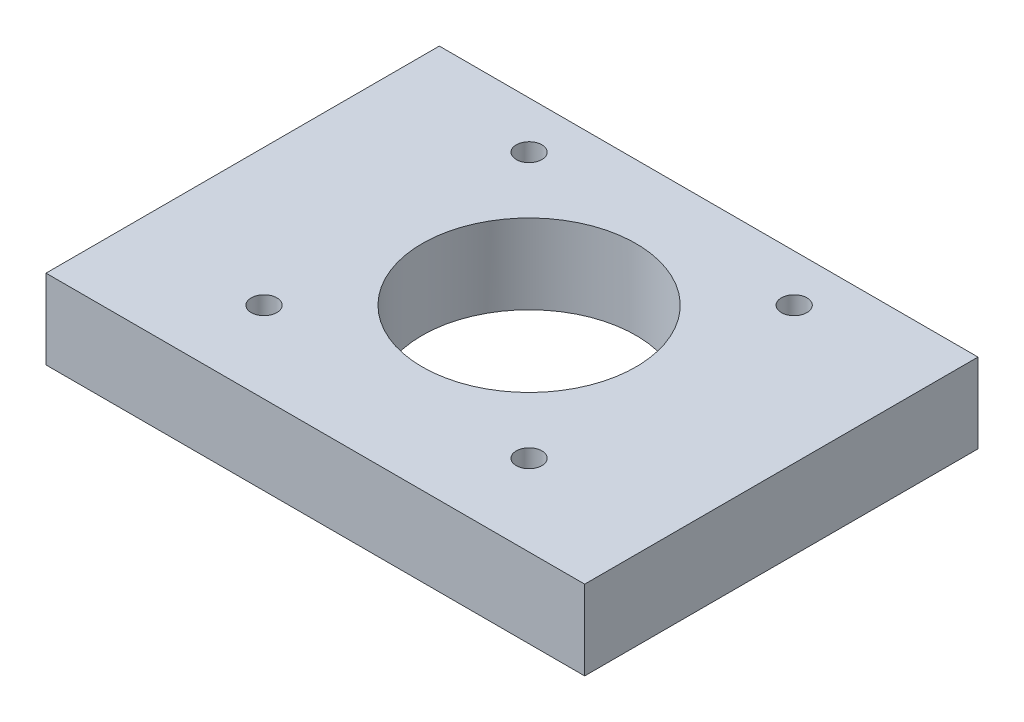
ISO-10303-21;
HEADER;
FILE_DESCRIPTION(('STEP AP214'),'2;1');
FILE_NAME('part.step','',(''),(''),'','','');
FILE_SCHEMA(('AUTOMOTIVE_DESIGN { 1 0 10303 214 1 1 1 1 }'));
ENDSEC;
DATA;
#1=APPLICATION_CONTEXT('core data for automotive mechanical design processes');
#2=APPLICATION_PROTOCOL_DEFINITION('international standard','automotive_design',2000,#1);
#3=PRODUCT_CONTEXT('',#1,'mechanical');
#4=PRODUCT('Part','Part','',(#3));
#5=PRODUCT_RELATED_PRODUCT_CATEGORY('part','',(#4));
#6=PRODUCT_DEFINITION_FORMATION('','',#4);
#7=PRODUCT_DEFINITION_CONTEXT('part definition',#1,'design');
#8=PRODUCT_DEFINITION('design','',#6,#7);
#9=PRODUCT_DEFINITION_SHAPE('','',#8);
#10=(LENGTH_UNIT() NAMED_UNIT(*) SI_UNIT(.MILLI.,.METRE.));
#11=(NAMED_UNIT(*) PLANE_ANGLE_UNIT() SI_UNIT($,.RADIAN.));
#12=(NAMED_UNIT(*) SI_UNIT($,.STERADIAN.) SOLID_ANGLE_UNIT());
#13=UNCERTAINTY_MEASURE_WITH_UNIT(LENGTH_MEASURE(1.E-05),#10,'distance_accuracy_value','');
#14=(GEOMETRIC_REPRESENTATION_CONTEXT(3) GLOBAL_UNCERTAINTY_ASSIGNED_CONTEXT((#13)) GLOBAL_UNIT_ASSIGNED_CONTEXT((#10,
#11,#12)) REPRESENTATION_CONTEXT('',''));
#15=CARTESIAN_POINT('',(0.,0.,0.));
#16=DIRECTION('',(0.,0.,1.));
#17=DIRECTION('',(1.,0.,0.));
#18=AXIS2_PLACEMENT_3D('',#15,#16,#17);
#19=CARTESIAN_POINT('',(31.5,9.3,46.));
#20=DIRECTION('',(-1.,0.,0.));
#21=DIRECTION('',(0.,0.,1.));
#22=AXIS2_PLACEMENT_3D('',#19,#20,#21);
#23=PLANE('',#22);
#24=DIRECTION('',(0.,1.,0.));
#25=VECTOR('',#24,1.);
#26=CARTESIAN_POINT('',(31.5,9.3,0.));
#27=LINE('',#26,#25);
#28=CARTESIAN_POINT('',(31.5,0.,0.));
#29=VERTEX_POINT('',#28);
#30=CARTESIAN_POINT('',(31.5,9.3,0.));
#31=VERTEX_POINT('',#30);
#32=EDGE_CURVE('E95',#29,#31,#27,.T.);
#33=ORIENTED_EDGE('',*,*,#32,.T.);
#34=DIRECTION('',(0.,0.,-1.));
#35=VECTOR('',#34,1.);
#36=CARTESIAN_POINT('',(31.5,9.3,46.));
#37=LINE('',#36,#35);
#38=CARTESIAN_POINT('',(31.5,9.3,46.));
#39=VERTEX_POINT('',#38);
#40=EDGE_CURVE('E48',#39,#31,#37,.T.);
#41=ORIENTED_EDGE('',*,*,#40,.F.);
#42=DIRECTION('',(0.,1.,0.));
#43=VECTOR('',#42,1.);
#44=CARTESIAN_POINT('',(31.5,9.3,46.));
#45=LINE('',#44,#43);
#46=CARTESIAN_POINT('',(31.5,0.,46.));
#47=VERTEX_POINT('',#46);
#48=EDGE_CURVE('E87',#47,#39,#45,.T.);
#49=ORIENTED_EDGE('',*,*,#48,.F.);
#50=DIRECTION('',(0.,0.,-1.));
#51=VECTOR('',#50,1.);
#52=CARTESIAN_POINT('',(31.5,0.,46.));
#53=LINE('',#52,#51);
#54=EDGE_CURVE('E11',#47,#29,#53,.T.);
#55=ORIENTED_EDGE('',*,*,#54,.T.);
#56=EDGE_LOOP('',(#33,#41,#49,#55));
#57=FACE_BOUND('',#56,.T.);
#58=ADVANCED_FACE('F39',(#57),#23,.F.);
#59=CARTESIAN_POINT('',(-31.5,9.3,46.));
#60=DIRECTION('',(0.,-1.,0.));
#61=DIRECTION('',(0.,0.,-1.));
#62=AXIS2_PLACEMENT_3D('',#59,#60,#61);
#63=PLANE('',#62);
#64=CARTESIAN_POINT('',(15.5,9.3,36.5));
#65=DIRECTION('',(0.,1.,0.));
#66=DIRECTION('',(0.,0.,1.));
#67=AXIS2_PLACEMENT_3D('',#64,#65,#66);
#68=CIRCLE('',#67,1.5);
#69=CARTESIAN_POINT('',(15.5,9.3,38.));
#70=VERTEX_POINT('',#69);
#71=EDGE_CURVE('E148',#70,#70,#68,.T.);
#72=ORIENTED_EDGE('',*,*,#71,.F.);
#73=EDGE_LOOP('',(#72));
#74=FACE_BOUND('',#73,.T.);
#75=CARTESIAN_POINT('',(15.5,9.3,5.49999999999999));
#76=DIRECTION('',(0.,1.,0.));
#77=DIRECTION('',(0.,0.,-1.));
#78=AXIS2_PLACEMENT_3D('',#75,#76,#77);
#79=CIRCLE('',#78,1.5);
#80=CARTESIAN_POINT('',(15.5,9.3,3.99999999999999));
#81=VERTEX_POINT('',#80);
#82=EDGE_CURVE('E152',#81,#81,#79,.T.);
#83=ORIENTED_EDGE('',*,*,#82,.F.);
#84=EDGE_LOOP('',(#83));
#85=FACE_BOUND('',#84,.T.);
#86=CARTESIAN_POINT('',(-15.5,9.3,36.5));
#87=DIRECTION('',(0.,1.,0.));
#88=DIRECTION('',(0.,0.,-1.));
#89=AXIS2_PLACEMENT_3D('',#86,#87,#88);
#90=CIRCLE('',#89,1.5);
#91=CARTESIAN_POINT('',(-15.5,9.3,35.));
#92=VERTEX_POINT('',#91);
#93=EDGE_CURVE('E156',#92,#92,#90,.T.);
#94=ORIENTED_EDGE('',*,*,#93,.F.);
#95=EDGE_LOOP('',(#94));
#96=FACE_BOUND('',#95,.T.);
#97=CARTESIAN_POINT('',(-15.5,9.3,5.49999999999999));
#98=DIRECTION('',(0.,1.,0.));
#99=DIRECTION('',(0.,0.,1.));
#100=AXIS2_PLACEMENT_3D('',#97,#98,#99);
#101=CIRCLE('',#100,1.5);
#102=CARTESIAN_POINT('',(-15.5,9.3,6.99999999999999));
#103=VERTEX_POINT('',#102);
#104=EDGE_CURVE('E160',#103,#103,#101,.T.);
#105=ORIENTED_EDGE('',*,*,#104,.F.);
#106=EDGE_LOOP('',(#105));
#107=FACE_BOUND('',#106,.T.);
#108=CARTESIAN_POINT('',(0.,9.3,21.));
#109=DIRECTION('',(0.,1.,0.));
#110=DIRECTION('',(0.,0.,1.));
#111=AXIS2_PLACEMENT_3D('',#108,#109,#110);
#112=CIRCLE('',#111,12.5);
#113=CARTESIAN_POINT('',(0.,9.3,33.5));
#114=VERTEX_POINT('',#113);
#115=EDGE_CURVE('E163',#114,#114,#112,.T.);
#116=ORIENTED_EDGE('',*,*,#115,.F.);
#117=EDGE_LOOP('',(#116));
#118=FACE_BOUND('',#117,.T.);
#119=DIRECTION('',(-1.,0.,0.));
#120=VECTOR('',#119,1.);
#121=CARTESIAN_POINT('',(-31.5,9.3,0.));
#122=LINE('',#121,#120);
#123=CARTESIAN_POINT('',(-31.5,9.3,0.));
#124=VERTEX_POINT('',#123);
#125=EDGE_CURVE('E74',#31,#124,#122,.T.);
#126=ORIENTED_EDGE('',*,*,#125,.T.);
#127=DIRECTION('',(0.,0.,-1.));
#128=VECTOR('',#127,1.);
#129=CARTESIAN_POINT('',(-31.5,9.3,46.));
#130=LINE('',#129,#128);
#131=CARTESIAN_POINT('',(-31.5,9.3,46.));
#132=VERTEX_POINT('',#131);
#133=EDGE_CURVE('E97',#132,#124,#130,.T.);
#134=ORIENTED_EDGE('',*,*,#133,.F.);
#135=DIRECTION('',(-1.,0.,0.));
#136=VECTOR('',#135,1.);
#137=CARTESIAN_POINT('',(-31.5,9.3,46.));
#138=LINE('',#137,#136);
#139=EDGE_CURVE('E91',#39,#132,#138,.T.);
#140=ORIENTED_EDGE('',*,*,#139,.F.);
#141=ORIENTED_EDGE('',*,*,#40,.T.);
#142=EDGE_LOOP('',(#126,#134,#140,#141));
#143=FACE_BOUND('',#142,.T.);
#144=ADVANCED_FACE('F98',(#74,#85,#96,#107,#118,#143),#63,.F.);
#145=CARTESIAN_POINT('',(-31.5,0.,46.));
#146=DIRECTION('',(1.,0.,0.));
#147=DIRECTION('',(0.,0.,-1.));
#148=AXIS2_PLACEMENT_3D('',#145,#146,#147);
#149=PLANE('',#148);
#150=DIRECTION('',(0.,-1.,0.));
#151=VECTOR('',#150,1.);
#152=CARTESIAN_POINT('',(-31.5,0.,0.));
#153=LINE('',#152,#151);
#154=CARTESIAN_POINT('',(-31.5,0.,0.));
#155=VERTEX_POINT('',#154);
#156=EDGE_CURVE('E81',#124,#155,#153,.T.);
#157=ORIENTED_EDGE('',*,*,#156,.T.);
#158=DIRECTION('',(0.,0.,-1.));
#159=VECTOR('',#158,1.);
#160=CARTESIAN_POINT('',(-31.5,0.,46.));
#161=LINE('',#160,#159);
#162=CARTESIAN_POINT('',(-31.5,0.,46.));
#163=VERTEX_POINT('',#162);
#164=EDGE_CURVE('E104',#163,#155,#161,.T.);
#165=ORIENTED_EDGE('',*,*,#164,.F.);
#166=DIRECTION('',(0.,-1.,0.));
#167=VECTOR('',#166,1.);
#168=CARTESIAN_POINT('',(-31.5,0.,46.));
#169=LINE('',#168,#167);
#170=EDGE_CURVE('E101',#132,#163,#169,.T.);
#171=ORIENTED_EDGE('',*,*,#170,.F.);
#172=ORIENTED_EDGE('',*,*,#133,.T.);
#173=EDGE_LOOP('',(#157,#165,#171,#172));
#174=FACE_BOUND('',#173,.T.);
#175=ADVANCED_FACE('F121',(#174),#149,.F.);
#176=CARTESIAN_POINT('',(0.,0.,46.));
#177=DIRECTION('',(0.,1.,0.));
#178=DIRECTION('',(-1.,0.,0.));
#179=AXIS2_PLACEMENT_3D('',#176,#177,#178);
#180=PLANE('',#179);
#181=CARTESIAN_POINT('',(15.5,0.,36.5));
#182=DIRECTION('',(0.,1.,0.));
#183=DIRECTION('',(-1.,0.,0.));
#184=AXIS2_PLACEMENT_3D('',#181,#182,#183);
#185=CIRCLE('',#184,1.5);
#186=CARTESIAN_POINT('',(14.,0.,36.5));
#187=VERTEX_POINT('',#186);
#188=EDGE_CURVE('E175',#187,#187,#185,.F.);
#189=ORIENTED_EDGE('',*,*,#188,.F.);
#190=EDGE_LOOP('',(#189));
#191=FACE_BOUND('',#190,.T.);
#192=CARTESIAN_POINT('',(15.5,0.,5.49999999999999));
#193=DIRECTION('',(0.,1.,0.));
#194=DIRECTION('',(-1.,0.,0.));
#195=AXIS2_PLACEMENT_3D('',#192,#193,#194);
#196=CIRCLE('',#195,1.5);
#197=CARTESIAN_POINT('',(14.,0.,5.49999999999999));
#198=VERTEX_POINT('',#197);
#199=EDGE_CURVE('E182',#198,#198,#196,.F.);
#200=ORIENTED_EDGE('',*,*,#199,.F.);
#201=EDGE_LOOP('',(#200));
#202=FACE_BOUND('',#201,.T.);
#203=CARTESIAN_POINT('',(-15.5,0.,36.5));
#204=DIRECTION('',(0.,1.,0.));
#205=DIRECTION('',(-1.,0.,0.));
#206=AXIS2_PLACEMENT_3D('',#203,#204,#205);
#207=CIRCLE('',#206,1.5);
#208=CARTESIAN_POINT('',(-17.,0.,36.5));
#209=VERTEX_POINT('',#208);
#210=EDGE_CURVE('E188',#209,#209,#207,.F.);
#211=ORIENTED_EDGE('',*,*,#210,.F.);
#212=EDGE_LOOP('',(#211));
#213=FACE_BOUND('',#212,.T.);
#214=CARTESIAN_POINT('',(-15.5,0.,5.49999999999999));
#215=DIRECTION('',(0.,1.,0.));
#216=DIRECTION('',(-1.,0.,0.));
#217=AXIS2_PLACEMENT_3D('',#214,#215,#216);
#218=CIRCLE('',#217,1.5);
#219=CARTESIAN_POINT('',(-17.,0.,5.49999999999999));
#220=VERTEX_POINT('',#219);
#221=EDGE_CURVE('E166',#220,#220,#218,.F.);
#222=ORIENTED_EDGE('',*,*,#221,.F.);
#223=EDGE_LOOP('',(#222));
#224=FACE_BOUND('',#223,.T.);
#225=CARTESIAN_POINT('',(0.,0.,21.));
#226=DIRECTION('',(0.,1.,0.));
#227=DIRECTION('',(-1.,0.,0.));
#228=AXIS2_PLACEMENT_3D('',#225,#226,#227);
#229=CIRCLE('',#228,12.5);
#230=CARTESIAN_POINT('',(-12.5,0.,21.));
#231=VERTEX_POINT('',#230);
#232=EDGE_CURVE('E110',#231,#231,#229,.F.);
#233=ORIENTED_EDGE('',*,*,#232,.F.);
#234=EDGE_LOOP('',(#233));
#235=FACE_BOUND('',#234,.T.);
#236=DIRECTION('',(1.,0.,0.));
#237=VECTOR('',#236,1.);
#238=CARTESIAN_POINT('',(0.,0.,0.));
#239=LINE('',#238,#237);
#240=EDGE_CURVE('E115',#155,#29,#239,.T.);
#241=ORIENTED_EDGE('',*,*,#240,.T.);
#242=ORIENTED_EDGE('',*,*,#54,.F.);
#243=DIRECTION('',(1.,0.,0.));
#244=VECTOR('',#243,1.);
#245=CARTESIAN_POINT('',(31.5,0.,46.));
#246=LINE('',#245,#244);
#247=EDGE_CURVE('E56',#163,#47,#246,.T.);
#248=ORIENTED_EDGE('',*,*,#247,.F.);
#249=ORIENTED_EDGE('',*,*,#164,.T.);
#250=EDGE_LOOP('',(#241,#242,#248,#249));
#251=FACE_BOUND('',#250,.T.);
#252=ADVANCED_FACE('F125',(#191,#202,#213,#224,#235,#251),#180,.F.);
#253=CARTESIAN_POINT('',(0.,0.,46.));
#254=DIRECTION('',(0.,0.,-1.));
#255=DIRECTION('',(-1.,0.,0.));
#256=AXIS2_PLACEMENT_3D('',#253,#254,#255);
#257=PLANE('',#256);
#258=ORIENTED_EDGE('',*,*,#247,.T.);
#259=ORIENTED_EDGE('',*,*,#48,.T.);
#260=ORIENTED_EDGE('',*,*,#139,.T.);
#261=ORIENTED_EDGE('',*,*,#170,.T.);
#262=EDGE_LOOP('',(#258,#259,#260,#261));
#263=FACE_BOUND('',#262,.T.);
#264=ADVANCED_FACE('F89',(#263),#257,.F.);
#265=CARTESIAN_POINT('',(0.,0.,0.));
#266=DIRECTION('',(0.,0.,-1.));
#267=DIRECTION('',(-1.,0.,0.));
#268=AXIS2_PLACEMENT_3D('',#265,#266,#267);
#269=PLANE('',#268);
#270=ORIENTED_EDGE('',*,*,#32,.F.);
#271=ORIENTED_EDGE('',*,*,#240,.F.);
#272=ORIENTED_EDGE('',*,*,#156,.F.);
#273=ORIENTED_EDGE('',*,*,#125,.F.);
#274=EDGE_LOOP('',(#270,#271,#272,#273));
#275=FACE_BOUND('',#274,.T.);
#276=ADVANCED_FACE('F124',(#275),#269,.T.);
#277=CARTESIAN_POINT('',(0.,-0.001000000000001,21.));
#278=DIRECTION('',(0.,1.,0.));
#279=DIRECTION('',(0.,0.,1.));
#280=AXIS2_PLACEMENT_3D('',#277,#278,#279);
#281=CYLINDRICAL_SURFACE('',#280,12.5);
#282=ORIENTED_EDGE('',*,*,#115,.T.);
#283=EDGE_LOOP('',(#282));
#284=FACE_BOUND('',#283,.T.);
#285=ORIENTED_EDGE('',*,*,#232,.T.);
#286=EDGE_LOOP('',(#285));
#287=FACE_BOUND('',#286,.T.);
#288=ADVANCED_FACE('F200',(#284,#287),#281,.F.);
#289=CARTESIAN_POINT('',(-15.5,-0.001000000000001,5.49999999999999));
#290=DIRECTION('',(0.,1.,0.));
#291=DIRECTION('',(0.,0.,1.));
#292=AXIS2_PLACEMENT_3D('',#289,#290,#291);
#293=CYLINDRICAL_SURFACE('',#292,1.5);
#294=ORIENTED_EDGE('',*,*,#104,.T.);
#295=EDGE_LOOP('',(#294));
#296=FACE_BOUND('',#295,.T.);
#297=ORIENTED_EDGE('',*,*,#221,.T.);
#298=EDGE_LOOP('',(#297));
#299=FACE_BOUND('',#298,.T.);
#300=ADVANCED_FACE('F196',(#296,#299),#293,.F.);
#301=CARTESIAN_POINT('',(-15.5,-0.001000000000001,36.5));
#302=DIRECTION('',(0.,1.,0.));
#303=DIRECTION('',(0.,0.,1.));
#304=AXIS2_PLACEMENT_3D('',#301,#302,#303);
#305=CYLINDRICAL_SURFACE('',#304,1.5);
#306=ORIENTED_EDGE('',*,*,#93,.T.);
#307=EDGE_LOOP('',(#306));
#308=FACE_BOUND('',#307,.T.);
#309=ORIENTED_EDGE('',*,*,#210,.T.);
#310=EDGE_LOOP('',(#309));
#311=FACE_BOUND('',#310,.T.);
#312=ADVANCED_FACE('F199',(#308,#311),#305,.F.);
#313=CARTESIAN_POINT('',(15.5,-0.001000000000001,5.49999999999999));
#314=DIRECTION('',(0.,1.,0.));
#315=DIRECTION('',(0.,0.,1.));
#316=AXIS2_PLACEMENT_3D('',#313,#314,#315);
#317=CYLINDRICAL_SURFACE('',#316,1.5);
#318=ORIENTED_EDGE('',*,*,#82,.T.);
#319=EDGE_LOOP('',(#318));
#320=FACE_BOUND('',#319,.T.);
#321=ORIENTED_EDGE('',*,*,#199,.T.);
#322=EDGE_LOOP('',(#321));
#323=FACE_BOUND('',#322,.T.);
#324=ADVANCED_FACE('F216',(#320,#323),#317,.F.);
#325=CARTESIAN_POINT('',(15.5,-0.001000000000001,36.5));
#326=DIRECTION('',(0.,1.,0.));
#327=DIRECTION('',(0.,0.,1.));
#328=AXIS2_PLACEMENT_3D('',#325,#326,#327);
#329=CYLINDRICAL_SURFACE('',#328,1.5);
#330=ORIENTED_EDGE('',*,*,#71,.T.);
#331=EDGE_LOOP('',(#330));
#332=FACE_BOUND('',#331,.T.);
#333=ORIENTED_EDGE('',*,*,#188,.T.);
#334=EDGE_LOOP('',(#333));
#335=FACE_BOUND('',#334,.T.);
#336=ADVANCED_FACE('F213',(#332,#335),#329,.F.);
#337=CLOSED_SHELL('',(#58,#144,#175,#252,#264,#276,#288,#300,#312,#324,#336));
#338=MANIFOLD_SOLID_BREP('B2',#337);
#339=ADVANCED_BREP_SHAPE_REPRESENTATION('',(#18,#338),#14);
#340=SHAPE_DEFINITION_REPRESENTATION(#9,#339);
ENDSEC;
END-ISO-10303-21;
